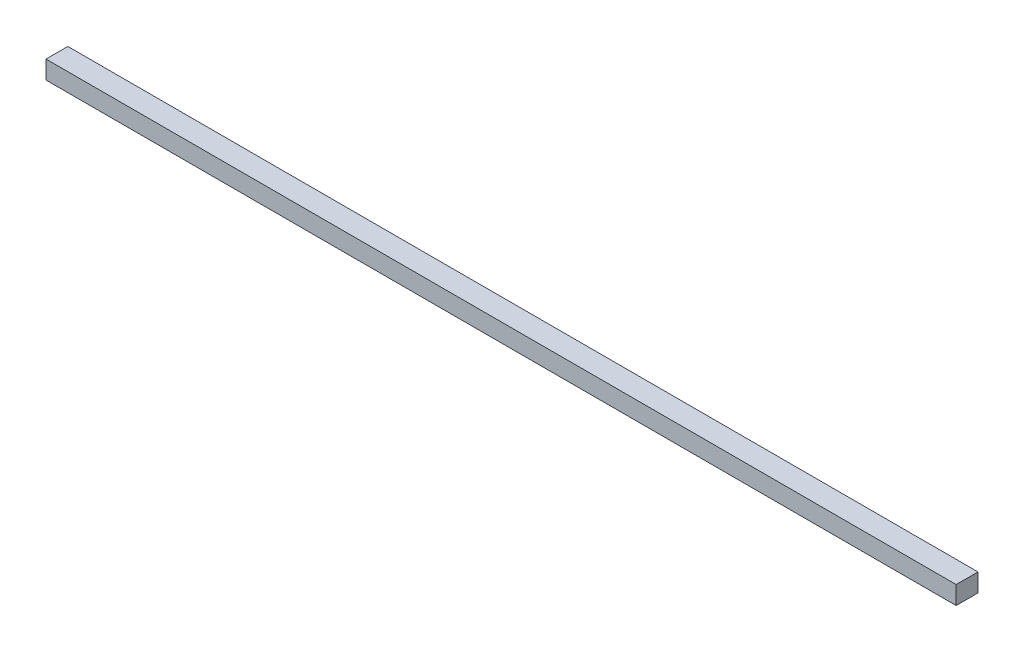
ISO-10303-21;
HEADER;
FILE_DESCRIPTION(('STEP AP214'),'2;1');
FILE_NAME('part.step','',(''),(''),'','','');
FILE_SCHEMA(('AUTOMOTIVE_DESIGN { 1 0 10303 214 1 1 1 1 }'));
ENDSEC;
DATA;
#1=APPLICATION_CONTEXT('core data for automotive mechanical design processes');
#2=APPLICATION_PROTOCOL_DEFINITION('international standard','automotive_design',2000,#1);
#3=PRODUCT_CONTEXT('',#1,'mechanical');
#4=PRODUCT('Part','Part','',(#3));
#5=PRODUCT_RELATED_PRODUCT_CATEGORY('part','',(#4));
#6=PRODUCT_DEFINITION_FORMATION('','',#4);
#7=PRODUCT_DEFINITION_CONTEXT('part definition',#1,'design');
#8=PRODUCT_DEFINITION('design','',#6,#7);
#9=PRODUCT_DEFINITION_SHAPE('','',#8);
#10=(LENGTH_UNIT() NAMED_UNIT(*) SI_UNIT(.MILLI.,.METRE.));
#11=(NAMED_UNIT(*) PLANE_ANGLE_UNIT() SI_UNIT($,.RADIAN.));
#12=(NAMED_UNIT(*) SI_UNIT($,.STERADIAN.) SOLID_ANGLE_UNIT());
#13=UNCERTAINTY_MEASURE_WITH_UNIT(LENGTH_MEASURE(1.E-05),#10,'distance_accuracy_value','');
#14=(GEOMETRIC_REPRESENTATION_CONTEXT(3) GLOBAL_UNCERTAINTY_ASSIGNED_CONTEXT((#13)) GLOBAL_UNIT_ASSIGNED_CONTEXT((#10,
#11,#12)) REPRESENTATION_CONTEXT('',''));
#15=CARTESIAN_POINT('',(0.,0.,0.));
#16=DIRECTION('',(0.,0.,1.));
#17=DIRECTION('',(1.,0.,0.));
#18=AXIS2_PLACEMENT_3D('',#15,#16,#17);
#19=CARTESIAN_POINT('',(-250.,10.,6.00000000000003));
#20=DIRECTION('',(1.,0.,0.));
#21=DIRECTION('',(0.,0.,-1.));
#22=AXIS2_PLACEMENT_3D('',#19,#20,#21);
#23=PLANE('',#22);
#24=DIRECTION('',(0.,0.,1.));
#25=VECTOR('',#24,1.);
#26=CARTESIAN_POINT('',(-250.,0.,6.00000000000003));
#27=LINE('',#26,#25);
#28=CARTESIAN_POINT('',(-250.,0.,-5.99999999999997));
#29=VERTEX_POINT('',#28);
#30=CARTESIAN_POINT('',(-250.,0.,6.00000000000003));
#31=VERTEX_POINT('',#30);
#32=EDGE_CURVE('E96',#29,#31,#27,.T.);
#33=ORIENTED_EDGE('',*,*,#32,.T.);
#34=DIRECTION('',(0.,-1.,0.));
#35=VECTOR('',#34,1.);
#36=CARTESIAN_POINT('',(-250.,10.,6.00000000000003));
#37=LINE('',#36,#35);
#38=CARTESIAN_POINT('',(-250.,10.,6.00000000000003));
#39=VERTEX_POINT('',#38);
#40=EDGE_CURVE('E11',#39,#31,#37,.T.);
#41=ORIENTED_EDGE('',*,*,#40,.F.);
#42=DIRECTION('',(0.,0.,1.));
#43=VECTOR('',#42,1.);
#44=CARTESIAN_POINT('',(-250.,10.,6.00000000000003));
#45=LINE('',#44,#43);
#46=CARTESIAN_POINT('',(-250.,10.,-5.99999999999997));
#47=VERTEX_POINT('',#46);
#48=EDGE_CURVE('E84',#47,#39,#45,.T.);
#49=ORIENTED_EDGE('',*,*,#48,.F.);
#50=DIRECTION('',(0.,-1.,0.));
#51=VECTOR('',#50,1.);
#52=CARTESIAN_POINT('',(-250.,10.,-5.99999999999997));
#53=LINE('',#52,#51);
#54=EDGE_CURVE('E92',#47,#29,#53,.T.);
#55=ORIENTED_EDGE('',*,*,#54,.T.);
#56=EDGE_LOOP('',(#33,#41,#49,#55));
#57=FACE_BOUND('',#56,.T.);
#58=ADVANCED_FACE('F33',(#57),#23,.F.);
#59=CARTESIAN_POINT('',(250.,10.,5.99999999999997));
#60=DIRECTION('',(0.,0.,-1.));
#61=DIRECTION('',(-1.,0.,0.));
#62=AXIS2_PLACEMENT_3D('',#59,#60,#61);
#63=PLANE('',#62);
#64=DIRECTION('',(1.,0.,0.));
#65=VECTOR('',#64,1.);
#66=CARTESIAN_POINT('',(250.,0.,5.99999999999997));
#67=LINE('',#66,#65);
#68=CARTESIAN_POINT('',(250.,0.,5.99999999999997));
#69=VERTEX_POINT('',#68);
#70=EDGE_CURVE('E88',#31,#69,#67,.T.);
#71=ORIENTED_EDGE('',*,*,#70,.T.);
#72=DIRECTION('',(0.,-1.,0.));
#73=VECTOR('',#72,1.);
#74=CARTESIAN_POINT('',(250.,10.,5.99999999999997));
#75=LINE('',#74,#73);
#76=CARTESIAN_POINT('',(250.,10.,5.99999999999997));
#77=VERTEX_POINT('',#76);
#78=EDGE_CURVE('E41',#77,#69,#75,.T.);
#79=ORIENTED_EDGE('',*,*,#78,.F.);
#80=DIRECTION('',(1.,0.,0.));
#81=VECTOR('',#80,1.);
#82=CARTESIAN_POINT('',(250.,10.,5.99999999999997));
#83=LINE('',#82,#81);
#84=EDGE_CURVE('E79',#39,#77,#83,.T.);
#85=ORIENTED_EDGE('',*,*,#84,.F.);
#86=ORIENTED_EDGE('',*,*,#40,.T.);
#87=EDGE_LOOP('',(#71,#79,#85,#86));
#88=FACE_BOUND('',#87,.T.);
#89=ADVANCED_FACE('F87',(#88),#63,.F.);
#90=CARTESIAN_POINT('',(250.,10.,5.99999999999997));
#91=DIRECTION('',(-1.,0.,0.));
#92=DIRECTION('',(0.,0.,1.));
#93=AXIS2_PLACEMENT_3D('',#90,#91,#92);
#94=PLANE('',#93);
#95=DIRECTION('',(0.,0.,-1.));
#96=VECTOR('',#95,1.);
#97=CARTESIAN_POINT('',(250.,0.,5.99999999999997));
#98=LINE('',#97,#96);
#99=CARTESIAN_POINT('',(250.,0.,-6.00000000000003));
#100=VERTEX_POINT('',#99);
#101=EDGE_CURVE('E66',#69,#100,#98,.T.);
#102=ORIENTED_EDGE('',*,*,#101,.T.);
#103=DIRECTION('',(0.,-1.,0.));
#104=VECTOR('',#103,1.);
#105=CARTESIAN_POINT('',(250.,10.,-6.00000000000003));
#106=LINE('',#105,#104);
#107=CARTESIAN_POINT('',(250.,10.,-6.00000000000003));
#108=VERTEX_POINT('',#107);
#109=EDGE_CURVE('E89',#108,#100,#106,.T.);
#110=ORIENTED_EDGE('',*,*,#109,.F.);
#111=DIRECTION('',(0.,0.,-1.));
#112=VECTOR('',#111,1.);
#113=CARTESIAN_POINT('',(250.,10.,5.99999999999997));
#114=LINE('',#113,#112);
#115=EDGE_CURVE('E82',#77,#108,#114,.T.);
#116=ORIENTED_EDGE('',*,*,#115,.F.);
#117=ORIENTED_EDGE('',*,*,#78,.T.);
#118=EDGE_LOOP('',(#102,#110,#116,#117));
#119=FACE_BOUND('',#118,.T.);
#120=ADVANCED_FACE('F90',(#119),#94,.F.);
#121=CARTESIAN_POINT('',(250.,10.,-6.00000000000003));
#122=DIRECTION('',(0.,0.,1.));
#123=DIRECTION('',(1.,0.,0.));
#124=AXIS2_PLACEMENT_3D('',#121,#122,#123);
#125=PLANE('',#124);
#126=DIRECTION('',(-1.,0.,0.));
#127=VECTOR('',#126,1.);
#128=CARTESIAN_POINT('',(250.,0.,-6.00000000000003));
#129=LINE('',#128,#127);
#130=EDGE_CURVE('E72',#100,#29,#129,.T.);
#131=ORIENTED_EDGE('',*,*,#130,.T.);
#132=ORIENTED_EDGE('',*,*,#54,.F.);
#133=DIRECTION('',(-1.,0.,0.));
#134=VECTOR('',#133,1.);
#135=CARTESIAN_POINT('',(250.,10.,-6.00000000000003));
#136=LINE('',#135,#134);
#137=EDGE_CURVE('E49',#108,#47,#136,.T.);
#138=ORIENTED_EDGE('',*,*,#137,.F.);
#139=ORIENTED_EDGE('',*,*,#109,.T.);
#140=EDGE_LOOP('',(#131,#132,#138,#139));
#141=FACE_BOUND('',#140,.T.);
#142=ADVANCED_FACE('F103',(#141),#125,.F.);
#143=CARTESIAN_POINT('',(0.,10.,0.));
#144=DIRECTION('',(0.,1.,0.));
#145=DIRECTION('',(0.,0.,1.));
#146=AXIS2_PLACEMENT_3D('',#143,#144,#145);
#147=PLANE('',#146);
#148=ORIENTED_EDGE('',*,*,#48,.T.);
#149=ORIENTED_EDGE('',*,*,#84,.T.);
#150=ORIENTED_EDGE('',*,*,#115,.T.);
#151=ORIENTED_EDGE('',*,*,#137,.T.);
#152=EDGE_LOOP('',(#148,#149,#150,#151));
#153=FACE_BOUND('',#152,.T.);
#154=ADVANCED_FACE('F80',(#153),#147,.T.);
#155=CARTESIAN_POINT('',(0.,0.,0.));
#156=DIRECTION('',(0.,1.,0.));
#157=DIRECTION('',(0.,0.,1.));
#158=AXIS2_PLACEMENT_3D('',#155,#156,#157);
#159=PLANE('',#158);
#160=ORIENTED_EDGE('',*,*,#32,.F.);
#161=ORIENTED_EDGE('',*,*,#130,.F.);
#162=ORIENTED_EDGE('',*,*,#101,.F.);
#163=ORIENTED_EDGE('',*,*,#70,.F.);
#164=EDGE_LOOP('',(#160,#161,#162,#163));
#165=FACE_BOUND('',#164,.T.);
#166=ADVANCED_FACE('F106',(#165),#159,.F.);
#167=CLOSED_SHELL('',(#58,#89,#120,#142,#154,#166));
#168=MANIFOLD_SOLID_BREP('B2',#167);
#169=ADVANCED_BREP_SHAPE_REPRESENTATION('',(#18,#168),#14);
#170=SHAPE_DEFINITION_REPRESENTATION(#9,#169);
ENDSEC;
END-ISO-10303-21;
